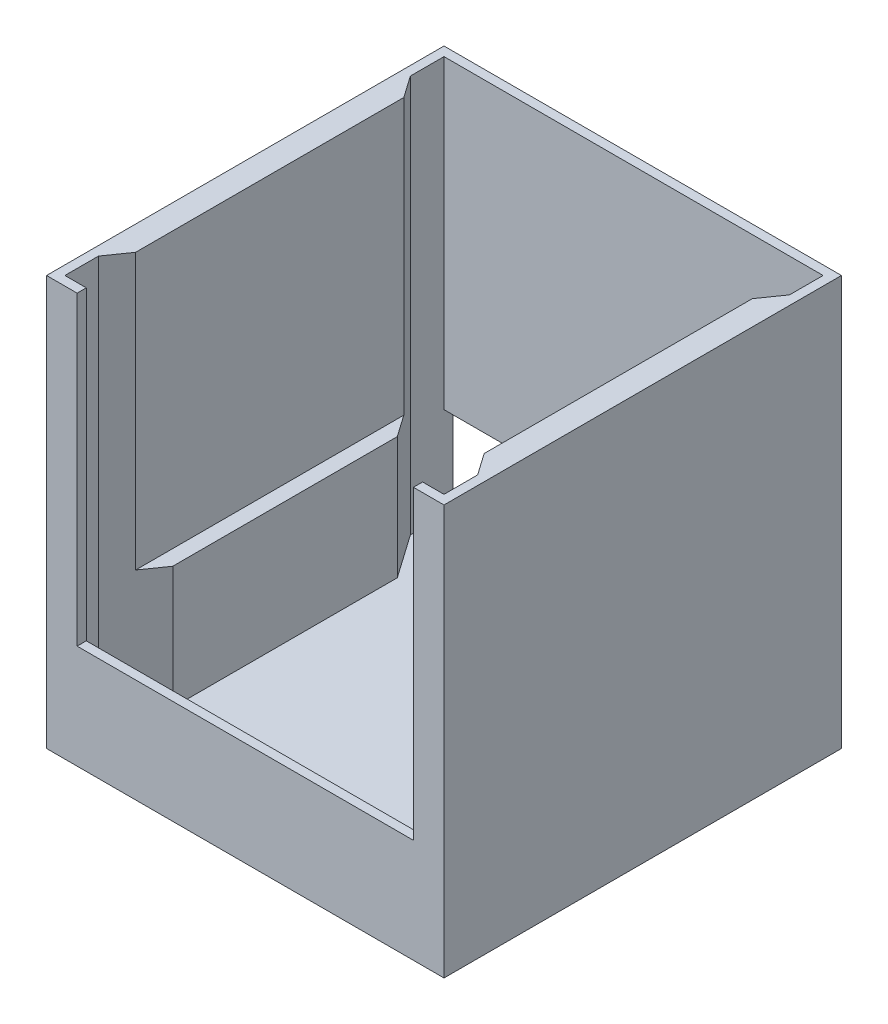
ISO-10303-21;
HEADER;
FILE_DESCRIPTION(('STEP AP214'),'2;1');
FILE_NAME('part.step','',(''),(''),'','','');
FILE_SCHEMA(('AUTOMOTIVE_DESIGN { 1 0 10303 214 1 1 1 1 }'));
ENDSEC;
DATA;
#1=APPLICATION_CONTEXT('core data for automotive mechanical design processes');
#2=APPLICATION_PROTOCOL_DEFINITION('international standard','automotive_design',2000,#1);
#3=PRODUCT_CONTEXT('',#1,'mechanical');
#4=PRODUCT('Part','Part','',(#3));
#5=PRODUCT_RELATED_PRODUCT_CATEGORY('part','',(#4));
#6=PRODUCT_DEFINITION_FORMATION('','',#4);
#7=PRODUCT_DEFINITION_CONTEXT('part definition',#1,'design');
#8=PRODUCT_DEFINITION('design','',#6,#7);
#9=PRODUCT_DEFINITION_SHAPE('','',#8);
#10=(LENGTH_UNIT() NAMED_UNIT(*) SI_UNIT(.MILLI.,.METRE.));
#11=(NAMED_UNIT(*) PLANE_ANGLE_UNIT() SI_UNIT($,.RADIAN.));
#12=(NAMED_UNIT(*) SI_UNIT($,.STERADIAN.) SOLID_ANGLE_UNIT());
#13=UNCERTAINTY_MEASURE_WITH_UNIT(LENGTH_MEASURE(1.E-05),#10,'distance_accuracy_value','');
#14=(GEOMETRIC_REPRESENTATION_CONTEXT(3) GLOBAL_UNCERTAINTY_ASSIGNED_CONTEXT((#13)) GLOBAL_UNIT_ASSIGNED_CONTEXT((#10,
#11,#12)) REPRESENTATION_CONTEXT('',''));
#15=CARTESIAN_POINT('',(0.,0.,0.));
#16=DIRECTION('',(0.,0.,1.));
#17=DIRECTION('',(1.,0.,0.));
#18=AXIS2_PLACEMENT_3D('',#15,#16,#17);
#19=CARTESIAN_POINT('',(72.39,127.,0.));
#20=DIRECTION('',(1.,0.,0.));
#21=DIRECTION('',(0.,0.,-1.));
#22=AXIS2_PLACEMENT_3D('',#19,#20,#21);
#23=PLANE('',#22);
#24=DIRECTION('',(0.,0.,1.));
#25=VECTOR('',#24,1.);
#26=CARTESIAN_POINT('',(72.39,127.,0.));
#27=LINE('',#26,#25);
#28=CARTESIAN_POINT('',(72.39,127.,-55.7012601571876));
#29=VERTEX_POINT('',#28);
#30=CARTESIAN_POINT('',(72.39,127.,55.7012601571877));
#31=VERTEX_POINT('',#30);
#32=EDGE_CURVE('E292',#29,#31,#27,.T.);
#33=ORIENTED_EDGE('',*,*,#32,.F.);
#34=DIRECTION('',(0.,-1.,0.));
#35=VECTOR('',#34,1.);
#36=CARTESIAN_POINT('',(72.39,127.,-55.7012601571876));
#37=LINE('',#36,#35);
#38=CARTESIAN_POINT('',(72.39,12.7,-55.7012601571877));
#39=VERTEX_POINT('',#38);
#40=EDGE_CURVE('E517',#29,#39,#37,.T.);
#41=ORIENTED_EDGE('',*,*,#40,.T.);
#42=DIRECTION('',(0.,0.,1.));
#43=VECTOR('',#42,1.);
#44=CARTESIAN_POINT('',(72.39,12.7,-64.77));
#45=LINE('',#44,#43);
#46=CARTESIAN_POINT('',(72.39,12.7,55.7012601571876));
#47=VERTEX_POINT('',#46);
#48=EDGE_CURVE('E525',#39,#47,#45,.T.);
#49=ORIENTED_EDGE('',*,*,#48,.T.);
#50=DIRECTION('',(0.,-1.,0.));
#51=VECTOR('',#50,1.);
#52=CARTESIAN_POINT('',(72.39,127.,55.7012601571876));
#53=LINE('',#52,#51);
#54=EDGE_CURVE('E514',#31,#47,#53,.T.);
#55=ORIENTED_EDGE('',*,*,#54,.F.);
#56=EDGE_LOOP('',(#33,#41,#49,#55));
#57=FACE_BOUND('',#56,.T.);
#58=ADVANCED_FACE('F45',(#57),#23,.F.);
#59=CARTESIAN_POINT('',(-72.39,127.,0.));
#60=DIRECTION('',(1.,0.,0.));
#61=DIRECTION('',(0.,0.,-1.));
#62=AXIS2_PLACEMENT_3D('',#59,#60,#61);
#63=PLANE('',#62);
#64=DIRECTION('',(0.,1.,0.));
#65=VECTOR('',#64,1.);
#66=CARTESIAN_POINT('',(-72.39,127.,55.7012601571876));
#67=LINE('',#66,#65);
#68=CARTESIAN_POINT('',(-72.39,12.7,55.7012601571876));
#69=VERTEX_POINT('',#68);
#70=CARTESIAN_POINT('',(-72.39,127.,55.7012601571876));
#71=VERTEX_POINT('',#70);
#72=EDGE_CURVE('E390',#69,#71,#67,.T.);
#73=ORIENTED_EDGE('',*,*,#72,.F.);
#74=DIRECTION('',(0.,0.,1.));
#75=VECTOR('',#74,1.);
#76=CARTESIAN_POINT('',(-72.39,12.7,0.));
#77=LINE('',#76,#75);
#78=CARTESIAN_POINT('',(-72.39,12.7,-55.7012601571876));
#79=VERTEX_POINT('',#78);
#80=EDGE_CURVE('E382',#79,#69,#77,.T.);
#81=ORIENTED_EDGE('',*,*,#80,.F.);
#82=DIRECTION('',(0.,1.,0.));
#83=VECTOR('',#82,1.);
#84=CARTESIAN_POINT('',(-72.39,127.,-55.7012601571876));
#85=LINE('',#84,#83);
#86=CARTESIAN_POINT('',(-72.39,127.,-55.7012601571876));
#87=VERTEX_POINT('',#86);
#88=EDGE_CURVE('E61',#79,#87,#85,.T.);
#89=ORIENTED_EDGE('',*,*,#88,.T.);
#90=DIRECTION('',(0.,0.,1.));
#91=VECTOR('',#90,1.);
#92=CARTESIAN_POINT('',(-72.39,127.,0.));
#93=LINE('',#92,#91);
#94=EDGE_CURVE('E305',#87,#71,#93,.T.);
#95=ORIENTED_EDGE('',*,*,#94,.T.);
#96=EDGE_LOOP('',(#73,#81,#89,#95));
#97=FACE_BOUND('',#96,.T.);
#98=ADVANCED_FACE('F388',(#97),#63,.T.);
#99=CARTESIAN_POINT('',(0.,127.,0.));
#100=DIRECTION('',(0.,1.,0.));
#101=DIRECTION('',(0.,0.,1.));
#102=AXIS2_PLACEMENT_3D('',#99,#100,#101);
#103=PLANE('',#102);
#104=DIRECTION('',(0.573576436351047,0.,-0.819152044288991));
#105=VECTOR('',#104,1.);
#106=CARTESIAN_POINT('',(-78.74,127.,64.77));
#107=LINE('',#106,#105);
#108=CARTESIAN_POINT('',(-78.74,127.,64.77));
#109=VERTEX_POINT('',#108);
#110=EDGE_CURVE('E489',#109,#71,#107,.T.);
#111=ORIENTED_EDGE('',*,*,#110,.T.);
#112=ORIENTED_EDGE('',*,*,#94,.F.);
#113=DIRECTION('',(0.573576436351048,0.,0.819152044288991));
#114=VECTOR('',#113,1.);
#115=CARTESIAN_POINT('',(-22.4033875185798,127.,15.6870208219429));
#116=LINE('',#115,#114);
#117=CARTESIAN_POINT('',(-78.74,127.,-64.77));
#118=VERTEX_POINT('',#117);
#119=EDGE_CURVE('E505',#118,#87,#116,.T.);
#120=ORIENTED_EDGE('',*,*,#119,.F.);
#121=DIRECTION('',(0.,0.,-1.));
#122=VECTOR('',#121,1.);
#123=CARTESIAN_POINT('',(-78.74,127.,0.));
#124=LINE('',#123,#122);
#125=CARTESIAN_POINT('',(-78.74,127.,-78.74));
#126=VERTEX_POINT('',#125);
#127=EDGE_CURVE('E306',#118,#126,#124,.T.);
#128=ORIENTED_EDGE('',*,*,#127,.T.);
#129=DIRECTION('',(1.,0.,0.));
#130=VECTOR('',#129,1.);
#131=CARTESIAN_POINT('',(0.,127.,-78.74));
#132=LINE('',#131,#130);
#133=CARTESIAN_POINT('',(78.74,127.,-78.74));
#134=VERTEX_POINT('',#133);
#135=EDGE_CURVE('E284',#126,#134,#132,.T.);
#136=ORIENTED_EDGE('',*,*,#135,.T.);
#137=DIRECTION('',(0.,0.,-1.));
#138=VECTOR('',#137,1.);
#139=CARTESIAN_POINT('',(78.74,127.,0.));
#140=LINE('',#139,#138);
#141=CARTESIAN_POINT('',(78.74,127.,-64.77));
#142=VERTEX_POINT('',#141);
#143=EDGE_CURVE('E287',#142,#134,#140,.T.);
#144=ORIENTED_EDGE('',*,*,#143,.F.);
#145=DIRECTION('',(-0.573576436351047,0.,0.819152044288991));
#146=VECTOR('',#145,1.);
#147=CARTESIAN_POINT('',(78.74,127.,-64.77));
#148=LINE('',#147,#146);
#149=EDGE_CURVE('E500',#142,#29,#148,.T.);
#150=ORIENTED_EDGE('',*,*,#149,.T.);
#151=ORIENTED_EDGE('',*,*,#32,.T.);
#152=DIRECTION('',(-0.573576436351047,0.,-0.819152044288991));
#153=VECTOR('',#152,1.);
#154=CARTESIAN_POINT('',(78.74,127.,64.77));
#155=LINE('',#154,#153);
#156=CARTESIAN_POINT('',(78.74,127.,64.77));
#157=VERTEX_POINT('',#156);
#158=EDGE_CURVE('E230',#157,#31,#155,.T.);
#159=ORIENTED_EDGE('',*,*,#158,.F.);
#160=CARTESIAN_POINT('',(78.74,127.,78.74));
#161=VERTEX_POINT('',#160);
#162=EDGE_CURVE('E239',#161,#157,#140,.T.);
#163=ORIENTED_EDGE('',*,*,#162,.F.);
#164=DIRECTION('',(1.,0.,0.));
#165=VECTOR('',#164,1.);
#166=CARTESIAN_POINT('',(0.,127.,78.74));
#167=LINE('',#166,#165);
#168=CARTESIAN_POINT('',(69.85,127.,78.74));
#169=VERTEX_POINT('',#168);
#170=EDGE_CURVE('E301',#169,#161,#167,.T.);
#171=ORIENTED_EDGE('',*,*,#170,.F.);
#172=DIRECTION('',(0.,0.,-1.));
#173=VECTOR('',#172,1.);
#174=CARTESIAN_POINT('',(69.85,127.,0.));
#175=LINE('',#174,#173);
#176=CARTESIAN_POINT('',(69.85,127.,82.5500000000001));
#177=VERTEX_POINT('',#176);
#178=EDGE_CURVE('E271',#177,#169,#175,.T.);
#179=ORIENTED_EDGE('',*,*,#178,.F.);
#180=DIRECTION('',(1.,0.,0.));
#181=VECTOR('',#180,1.);
#182=CARTESIAN_POINT('',(0.,127.,82.5500000000001));
#183=LINE('',#182,#181);
#184=CARTESIAN_POINT('',(82.55,127.,82.5500000000001));
#185=VERTEX_POINT('',#184);
#186=EDGE_CURVE('E321',#177,#185,#183,.T.);
#187=ORIENTED_EDGE('',*,*,#186,.T.);
#188=DIRECTION('',(0.,0.,-1.));
#189=VECTOR('',#188,1.);
#190=CARTESIAN_POINT('',(82.5499999999999,127.,0.));
#191=LINE('',#190,#189);
#192=CARTESIAN_POINT('',(82.5499999999999,127.,-82.5499999999999));
#193=VERTEX_POINT('',#192);
#194=EDGE_CURVE('E310',#185,#193,#191,.T.);
#195=ORIENTED_EDGE('',*,*,#194,.T.);
#196=DIRECTION('',(1.,0.,0.));
#197=VECTOR('',#196,1.);
#198=CARTESIAN_POINT('',(0.,127.,-82.5499999999999));
#199=LINE('',#198,#197);
#200=CARTESIAN_POINT('',(-82.5500000000001,127.,-82.5499999999999));
#201=VERTEX_POINT('',#200);
#202=EDGE_CURVE('E313',#201,#193,#199,.T.);
#203=ORIENTED_EDGE('',*,*,#202,.F.);
#204=DIRECTION('',(0.,0.,-1.));
#205=VECTOR('',#204,1.);
#206=CARTESIAN_POINT('',(-82.55,127.,0.));
#207=LINE('',#206,#205);
#208=CARTESIAN_POINT('',(-82.5499999999999,127.,82.5500000000001));
#209=VERTEX_POINT('',#208);
#210=EDGE_CURVE('E317',#209,#201,#207,.T.);
#211=ORIENTED_EDGE('',*,*,#210,.F.);
#212=CARTESIAN_POINT('',(-69.8499999999999,127.,82.5500000000001));
#213=VERTEX_POINT('',#212);
#214=EDGE_CURVE('E322',#209,#213,#183,.T.);
#215=ORIENTED_EDGE('',*,*,#214,.T.);
#216=DIRECTION('',(0.,0.,1.));
#217=VECTOR('',#216,1.);
#218=CARTESIAN_POINT('',(-69.8499999999999,127.,0.));
#219=LINE('',#218,#217);
#220=CARTESIAN_POINT('',(-69.8499999999999,127.,78.74));
#221=VERTEX_POINT('',#220);
#222=EDGE_CURVE('E367',#221,#213,#219,.T.);
#223=ORIENTED_EDGE('',*,*,#222,.F.);
#224=CARTESIAN_POINT('',(-78.74,127.,78.74));
#225=VERTEX_POINT('',#224);
#226=EDGE_CURVE('E296',#225,#221,#167,.T.);
#227=ORIENTED_EDGE('',*,*,#226,.F.);
#228=EDGE_CURVE('E300',#225,#109,#124,.T.);
#229=ORIENTED_EDGE('',*,*,#228,.T.);
#230=EDGE_LOOP('',(#111,#112,#120,#128,#136,#144,#150,#151,#159,#163,#171,#179,#187,#195,#203,
#211,#215,#223,#227,#229));
#231=FACE_BOUND('',#230,.T.);
#232=ADVANCED_FACE('F478',(#231),#103,.T.);
#233=CARTESIAN_POINT('',(-66.04,12.7,0.));
#234=DIRECTION('',(1.,0.,0.));
#235=DIRECTION('',(0.,0.,-1.));
#236=AXIS2_PLACEMENT_3D('',#233,#234,#235);
#237=PLANE('',#236);
#238=DIRECTION('',(0.,-1.,0.));
#239=VECTOR('',#238,1.);
#240=CARTESIAN_POINT('',(-66.04,127.,46.6325203143752));
#241=LINE('',#240,#239);
#242=CARTESIAN_POINT('',(-66.04,12.7,46.6325203143752));
#243=VERTEX_POINT('',#242);
#244=CARTESIAN_POINT('',(-66.04,-38.1,46.6325203143752));
#245=VERTEX_POINT('',#244);
#246=EDGE_CURVE('E68',#243,#245,#241,.T.);
#247=ORIENTED_EDGE('',*,*,#246,.T.);
#248=DIRECTION('',(0.,0.,1.));
#249=VECTOR('',#248,1.);
#250=CARTESIAN_POINT('',(-66.04,-38.1,0.));
#251=LINE('',#250,#249);
#252=CARTESIAN_POINT('',(-66.04,-38.1,-46.6325203143752));
#253=VERTEX_POINT('',#252);
#254=EDGE_CURVE('E399',#253,#245,#251,.T.);
#255=ORIENTED_EDGE('',*,*,#254,.F.);
#256=DIRECTION('',(0.,-1.,0.));
#257=VECTOR('',#256,1.);
#258=CARTESIAN_POINT('',(-66.04,127.,-46.6325203143752));
#259=LINE('',#258,#257);
#260=CARTESIAN_POINT('',(-66.04,12.7,-46.6325203143752));
#261=VERTEX_POINT('',#260);
#262=EDGE_CURVE('E508',#261,#253,#259,.T.);
#263=ORIENTED_EDGE('',*,*,#262,.F.);
#264=DIRECTION('',(0.,0.,1.));
#265=VECTOR('',#264,1.);
#266=CARTESIAN_POINT('',(-66.04,12.7,0.));
#267=LINE('',#266,#265);
#268=EDGE_CURVE('E384',#261,#243,#267,.T.);
#269=ORIENTED_EDGE('',*,*,#268,.T.);
#270=EDGE_LOOP('',(#247,#255,#263,#269));
#271=FACE_BOUND('',#270,.T.);
#272=ADVANCED_FACE('F566',(#271),#237,.T.);
#273=CARTESIAN_POINT('',(0.,12.7,0.));
#274=DIRECTION('',(0.,1.,0.));
#275=DIRECTION('',(0.,0.,1.));
#276=AXIS2_PLACEMENT_3D('',#273,#274,#275);
#277=PLANE('',#276);
#278=DIRECTION('',(-0.573576436351048,0.,0.819152044288991));
#279=VECTOR('',#278,1.);
#280=CARTESIAN_POINT('',(-22.4033875185798,12.7,-15.6870208219429));
#281=LINE('',#280,#279);
#282=EDGE_CURVE('E11',#243,#69,#281,.T.);
#283=ORIENTED_EDGE('',*,*,#282,.F.);
#284=ORIENTED_EDGE('',*,*,#268,.F.);
#285=DIRECTION('',(-0.573576436351048,0.,-0.819152044288991));
#286=VECTOR('',#285,1.);
#287=CARTESIAN_POINT('',(-22.4033875185798,12.7,15.6870208219429));
#288=LINE('',#287,#286);
#289=EDGE_CURVE('E54',#261,#79,#288,.T.);
#290=ORIENTED_EDGE('',*,*,#289,.T.);
#291=ORIENTED_EDGE('',*,*,#80,.T.);
#292=EDGE_LOOP('',(#283,#284,#290,#291));
#293=FACE_BOUND('',#292,.T.);
#294=ADVANCED_FACE('F381',(#293),#277,.T.);
#295=CARTESIAN_POINT('',(66.04,12.7,-64.77));
#296=DIRECTION('',(1.,0.,0.));
#297=DIRECTION('',(0.,0.,-1.));
#298=AXIS2_PLACEMENT_3D('',#295,#296,#297);
#299=PLANE('',#298);
#300=DIRECTION('',(0.,0.,1.));
#301=VECTOR('',#300,1.);
#302=CARTESIAN_POINT('',(66.04,12.7,-64.77));
#303=LINE('',#302,#301);
#304=CARTESIAN_POINT('',(66.04,12.7,-46.6325203143752));
#305=VERTEX_POINT('',#304);
#306=CARTESIAN_POINT('',(66.04,12.7,46.6325203143752));
#307=VERTEX_POINT('',#306);
#308=EDGE_CURVE('E528',#305,#307,#303,.T.);
#309=ORIENTED_EDGE('',*,*,#308,.F.);
#310=DIRECTION('',(0.,-1.,0.));
#311=VECTOR('',#310,1.);
#312=CARTESIAN_POINT('',(66.04,127.,-46.6325203143752));
#313=LINE('',#312,#311);
#314=CARTESIAN_POINT('',(66.04,-38.1,-46.6325203143752));
#315=VERTEX_POINT('',#314);
#316=EDGE_CURVE('E229',#305,#315,#313,.T.);
#317=ORIENTED_EDGE('',*,*,#316,.T.);
#318=DIRECTION('',(0.,0.,1.));
#319=VECTOR('',#318,1.);
#320=CARTESIAN_POINT('',(66.04,-38.1,-64.77));
#321=LINE('',#320,#319);
#322=CARTESIAN_POINT('',(66.04,-38.1,46.6325203143752));
#323=VERTEX_POINT('',#322);
#324=EDGE_CURVE('E405',#315,#323,#321,.T.);
#325=ORIENTED_EDGE('',*,*,#324,.T.);
#326=DIRECTION('',(0.,-1.,0.));
#327=VECTOR('',#326,1.);
#328=CARTESIAN_POINT('',(66.04,127.,46.6325203143752));
#329=LINE('',#328,#327);
#330=EDGE_CURVE('E223',#307,#323,#329,.T.);
#331=ORIENTED_EDGE('',*,*,#330,.F.);
#332=EDGE_LOOP('',(#309,#317,#325,#331));
#333=FACE_BOUND('',#332,.T.);
#334=ADVANCED_FACE('F539',(#333),#299,.F.);
#335=CARTESIAN_POINT('',(0.,12.7,0.));
#336=DIRECTION('',(0.,1.,0.));
#337=DIRECTION('',(0.,0.,1.));
#338=AXIS2_PLACEMENT_3D('',#335,#336,#337);
#339=PLANE('',#338);
#340=DIRECTION('',(0.573576436351048,0.,-0.819152044288991));
#341=VECTOR('',#340,1.);
#342=CARTESIAN_POINT('',(22.4033875185798,12.7,15.6870208219429));
#343=LINE('',#342,#341);
#344=EDGE_CURVE('E374',#305,#39,#343,.T.);
#345=ORIENTED_EDGE('',*,*,#344,.F.);
#346=ORIENTED_EDGE('',*,*,#308,.T.);
#347=DIRECTION('',(0.573576436351048,0.,0.819152044288991));
#348=VECTOR('',#347,1.);
#349=CARTESIAN_POINT('',(22.4033875185798,12.7,-15.6870208219429));
#350=LINE('',#349,#348);
#351=EDGE_CURVE('E370',#307,#47,#350,.T.);
#352=ORIENTED_EDGE('',*,*,#351,.T.);
#353=ORIENTED_EDGE('',*,*,#48,.F.);
#354=EDGE_LOOP('',(#345,#346,#352,#353));
#355=FACE_BOUND('',#354,.T.);
#356=ADVANCED_FACE('F536',(#355),#339,.T.);
#357=CARTESIAN_POINT('',(0.,-38.1,0.));
#358=DIRECTION('',(0.,-1.,0.));
#359=DIRECTION('',(0.,0.,-1.));
#360=AXIS2_PLACEMENT_3D('',#357,#358,#359);
#361=PLANE('',#360);
#362=DIRECTION('',(-0.573576436351047,0.,0.819152044288991));
#363=VECTOR('',#362,1.);
#364=CARTESIAN_POINT('',(78.74,-38.1,-64.77));
#365=LINE('',#364,#363);
#366=CARTESIAN_POINT('',(78.74,-38.1,-64.77));
#367=VERTEX_POINT('',#366);
#368=EDGE_CURVE('E490',#367,#315,#365,.T.);
#369=ORIENTED_EDGE('',*,*,#368,.F.);
#370=DIRECTION('',(0.,0.,-1.));
#371=VECTOR('',#370,1.);
#372=CARTESIAN_POINT('',(78.74,-38.1,0.));
#373=LINE('',#372,#371);
#374=CARTESIAN_POINT('',(78.74,-38.1,-82.5499999999999));
#375=VERTEX_POINT('',#374);
#376=EDGE_CURVE('E252',#367,#375,#373,.T.);
#377=ORIENTED_EDGE('',*,*,#376,.T.);
#378=DIRECTION('',(1.,0.,0.));
#379=VECTOR('',#378,1.);
#380=CARTESIAN_POINT('',(-82.5499999999999,-38.1,-82.5499999999999));
#381=LINE('',#380,#379);
#382=CARTESIAN_POINT('',(-78.74,-38.1,-82.5499999999999));
#383=VERTEX_POINT('',#382);
#384=EDGE_CURVE('E260',#383,#375,#381,.T.);
#385=ORIENTED_EDGE('',*,*,#384,.F.);
#386=DIRECTION('',(0.,0.,-1.));
#387=VECTOR('',#386,1.);
#388=CARTESIAN_POINT('',(-78.74,-38.1,0.));
#389=LINE('',#388,#387);
#390=CARTESIAN_POINT('',(-78.74,-38.1,-64.77));
#391=VERTEX_POINT('',#390);
#392=EDGE_CURVE('E251',#391,#383,#389,.T.);
#393=ORIENTED_EDGE('',*,*,#392,.F.);
#394=DIRECTION('',(0.573576436351048,0.,0.819152044288991));
#395=VECTOR('',#394,1.);
#396=CARTESIAN_POINT('',(-22.4033875185798,-38.1,15.6870208219429));
#397=LINE('',#396,#395);
#398=EDGE_CURVE('E494',#391,#253,#397,.T.);
#399=ORIENTED_EDGE('',*,*,#398,.T.);
#400=ORIENTED_EDGE('',*,*,#254,.T.);
#401=DIRECTION('',(0.573576436351047,0.,-0.819152044288991));
#402=VECTOR('',#401,1.);
#403=CARTESIAN_POINT('',(-78.74,-38.1,64.77));
#404=LINE('',#403,#402);
#405=CARTESIAN_POINT('',(-78.74,-38.1,64.77));
#406=VERTEX_POINT('',#405);
#407=EDGE_CURVE('E491',#406,#245,#404,.T.);
#408=ORIENTED_EDGE('',*,*,#407,.F.);
#409=CARTESIAN_POINT('',(-78.74,-38.1,78.74));
#410=VERTEX_POINT('',#409);
#411=EDGE_CURVE('E256',#410,#406,#389,.T.);
#412=ORIENTED_EDGE('',*,*,#411,.F.);
#413=DIRECTION('',(1.,0.,0.));
#414=VECTOR('',#413,1.);
#415=CARTESIAN_POINT('',(0.,-38.1,78.74));
#416=LINE('',#415,#414);
#417=CARTESIAN_POINT('',(78.74,-38.1,78.74));
#418=VERTEX_POINT('',#417);
#419=EDGE_CURVE('E249',#410,#418,#416,.T.);
#420=ORIENTED_EDGE('',*,*,#419,.T.);
#421=CARTESIAN_POINT('',(78.74,-38.1,64.77));
#422=VERTEX_POINT('',#421);
#423=EDGE_CURVE('E236',#418,#422,#373,.T.);
#424=ORIENTED_EDGE('',*,*,#423,.T.);
#425=DIRECTION('',(-0.573576436351047,0.,-0.819152044288991));
#426=VECTOR('',#425,1.);
#427=CARTESIAN_POINT('',(78.74,-38.1,64.77));
#428=LINE('',#427,#426);
#429=EDGE_CURVE('E217',#422,#323,#428,.T.);
#430=ORIENTED_EDGE('',*,*,#429,.T.);
#431=ORIENTED_EDGE('',*,*,#324,.F.);
#432=EDGE_LOOP('',(#369,#377,#385,#393,#399,#400,#408,#412,#420,#424,#430,#431));
#433=FACE_BOUND('',#432,.T.);
#434=ADVANCED_FACE('F246',(#433),#361,.F.);
#435=CARTESIAN_POINT('',(-78.74,127.,0.));
#436=DIRECTION('',(-1.,0.,0.));
#437=DIRECTION('',(0.,0.,1.));
#438=AXIS2_PLACEMENT_3D('',#435,#436,#437);
#439=PLANE('',#438);
#440=DIRECTION('',(0.,-1.,0.));
#441=VECTOR('',#440,1.);
#442=CARTESIAN_POINT('',(-78.74,127.,-64.77));
#443=LINE('',#442,#441);
#444=EDGE_CURVE('E348',#118,#391,#443,.T.);
#445=ORIENTED_EDGE('',*,*,#444,.T.);
#446=ORIENTED_EDGE('',*,*,#392,.T.);
#447=DIRECTION('',(0.,1.,0.));
#448=VECTOR('',#447,1.);
#449=CARTESIAN_POINT('',(-78.74,-38.1,-82.5499999999999));
#450=LINE('',#449,#448);
#451=CARTESIAN_POINT('',(-78.74,0.,-82.5499999999999));
#452=VERTEX_POINT('',#451);
#453=EDGE_CURVE('E267',#383,#452,#450,.T.);
#454=ORIENTED_EDGE('',*,*,#453,.T.);
#455=DIRECTION('',(0.,0.,-1.));
#456=VECTOR('',#455,1.);
#457=CARTESIAN_POINT('',(-78.74,0.,0.));
#458=LINE('',#457,#456);
#459=CARTESIAN_POINT('',(-78.74,0.,-78.74));
#460=VERTEX_POINT('',#459);
#461=EDGE_CURVE('E272',#460,#452,#458,.T.);
#462=ORIENTED_EDGE('',*,*,#461,.F.);
#463=DIRECTION('',(0.,-1.,0.));
#464=VECTOR('',#463,1.);
#465=CARTESIAN_POINT('',(-78.74,127.,-78.74));
#466=LINE('',#465,#464);
#467=EDGE_CURVE('E326',#126,#460,#466,.T.);
#468=ORIENTED_EDGE('',*,*,#467,.F.);
#469=ORIENTED_EDGE('',*,*,#127,.F.);
#470=EDGE_LOOP('',(#445,#446,#454,#462,#468,#469));
#471=FACE_BOUND('',#470,.T.);
#472=ADVANCED_FACE('F555',(#471),#439,.F.);
#473=CARTESIAN_POINT('',(78.74,127.,0.));
#474=DIRECTION('',(-1.,0.,0.));
#475=DIRECTION('',(0.,0.,1.));
#476=AXIS2_PLACEMENT_3D('',#473,#474,#475);
#477=PLANE('',#476);
#478=DIRECTION('',(0.,-1.,0.));
#479=VECTOR('',#478,1.);
#480=CARTESIAN_POINT('',(78.74,127.,64.77));
#481=LINE('',#480,#479);
#482=EDGE_CURVE('E220',#157,#422,#481,.T.);
#483=ORIENTED_EDGE('',*,*,#482,.T.);
#484=ORIENTED_EDGE('',*,*,#423,.F.);
#485=DIRECTION('',(0.,-1.,0.));
#486=VECTOR('',#485,1.);
#487=CARTESIAN_POINT('',(78.74,127.,78.74));
#488=LINE('',#487,#486);
#489=EDGE_CURVE('E242',#161,#418,#488,.T.);
#490=ORIENTED_EDGE('',*,*,#489,.F.);
#491=ORIENTED_EDGE('',*,*,#162,.T.);
#492=EDGE_LOOP('',(#483,#484,#490,#491));
#493=FACE_BOUND('',#492,.T.);
#494=ADVANCED_FACE('F234',(#493),#477,.T.);
#495=CARTESIAN_POINT('',(0.,0.,0.));
#496=DIRECTION('',(0.,1.,0.));
#497=DIRECTION('',(0.,0.,1.));
#498=AXIS2_PLACEMENT_3D('',#495,#496,#497);
#499=PLANE('',#498);
#500=DIRECTION('',(0.,0.,-1.));
#501=VECTOR('',#500,1.);
#502=CARTESIAN_POINT('',(78.74,0.,0.));
#503=LINE('',#502,#501);
#504=CARTESIAN_POINT('',(78.74,0.,-78.74));
#505=VERTEX_POINT('',#504);
#506=CARTESIAN_POINT('',(78.74,0.,-82.5499999999999));
#507=VERTEX_POINT('',#506);
#508=EDGE_CURVE('E268',#505,#507,#503,.T.);
#509=ORIENTED_EDGE('',*,*,#508,.F.);
#510=DIRECTION('',(1.,0.,0.));
#511=VECTOR('',#510,1.);
#512=CARTESIAN_POINT('',(0.,0.,-78.74));
#513=LINE('',#512,#511);
#514=EDGE_CURVE('E283',#460,#505,#513,.T.);
#515=ORIENTED_EDGE('',*,*,#514,.F.);
#516=ORIENTED_EDGE('',*,*,#461,.T.);
#517=DIRECTION('',(1.,0.,0.));
#518=VECTOR('',#517,1.);
#519=CARTESIAN_POINT('',(0.,0.,-82.5499999999999));
#520=LINE('',#519,#518);
#521=EDGE_CURVE('E288',#452,#507,#520,.T.);
#522=ORIENTED_EDGE('',*,*,#521,.T.);
#523=EDGE_LOOP('',(#509,#515,#516,#522));
#524=FACE_BOUND('',#523,.T.);
#525=ADVANCED_FACE('F603',(#524),#499,.F.);
#526=CARTESIAN_POINT('',(82.5499999999999,127.,0.));
#527=DIRECTION('',(-1.,0.,0.));
#528=DIRECTION('',(0.,0.,1.));
#529=AXIS2_PLACEMENT_3D('',#526,#527,#528);
#530=PLANE('',#529);
#531=DIRECTION('',(0.,-1.,0.));
#532=VECTOR('',#531,1.);
#533=CARTESIAN_POINT('',(82.55,127.,82.5500000000001));
#534=LINE('',#533,#532);
#535=CARTESIAN_POINT('',(82.5500000000001,-43.18,82.5500000000001));
#536=VERTEX_POINT('',#535);
#537=EDGE_CURVE('E333',#185,#536,#534,.T.);
#538=ORIENTED_EDGE('',*,*,#537,.T.);
#539=DIRECTION('',(0.,0.,1.));
#540=VECTOR('',#539,1.);
#541=CARTESIAN_POINT('',(82.5500000000001,-43.18,82.5500000000001));
#542=LINE('',#541,#540);
#543=CARTESIAN_POINT('',(82.5499999999999,-43.18,-82.5499999999999));
#544=VERTEX_POINT('',#543);
#545=EDGE_CURVE('E436',#544,#536,#542,.T.);
#546=ORIENTED_EDGE('',*,*,#545,.F.);
#547=DIRECTION('',(0.,-1.,0.));
#548=VECTOR('',#547,1.);
#549=CARTESIAN_POINT('',(82.5499999999999,127.,-82.5499999999999));
#550=LINE('',#549,#548);
#551=EDGE_CURVE('E276',#193,#544,#550,.T.);
#552=ORIENTED_EDGE('',*,*,#551,.F.);
#553=ORIENTED_EDGE('',*,*,#194,.F.);
#554=EDGE_LOOP('',(#538,#546,#552,#553));
#555=FACE_BOUND('',#554,.T.);
#556=ADVANCED_FACE('F459',(#555),#530,.F.);
#557=CARTESIAN_POINT('',(0.,127.,-82.5499999999999));
#558=DIRECTION('',(0.,0.,-1.));
#559=DIRECTION('',(-1.,0.,0.));
#560=AXIS2_PLACEMENT_3D('',#557,#558,#559);
#561=PLANE('',#560);
#562=ORIENTED_EDGE('',*,*,#551,.T.);
#563=DIRECTION('',(1.,0.,0.));
#564=VECTOR('',#563,1.);
#565=CARTESIAN_POINT('',(-82.5499999999999,-43.18,-82.5499999999999));
#566=LINE('',#565,#564);
#567=CARTESIAN_POINT('',(-82.5499999999999,-43.18,-82.5499999999999));
#568=VERTEX_POINT('',#567);
#569=EDGE_CURVE('E432',#568,#544,#566,.T.);
#570=ORIENTED_EDGE('',*,*,#569,.F.);
#571=DIRECTION('',(0.,-1.,0.));
#572=VECTOR('',#571,1.);
#573=CARTESIAN_POINT('',(-82.5500000000001,127.,-82.5499999999999));
#574=LINE('',#573,#572);
#575=EDGE_CURVE('E340',#201,#568,#574,.T.);
#576=ORIENTED_EDGE('',*,*,#575,.F.);
#577=ORIENTED_EDGE('',*,*,#202,.T.);
#578=EDGE_LOOP('',(#562,#570,#576,#577));
#579=FACE_BOUND('',#578,.T.);
#580=ORIENTED_EDGE('',*,*,#521,.F.);
#581=ORIENTED_EDGE('',*,*,#453,.F.);
#582=ORIENTED_EDGE('',*,*,#384,.T.);
#583=DIRECTION('',(0.,1.,0.));
#584=VECTOR('',#583,1.);
#585=CARTESIAN_POINT('',(78.74,-38.1,-82.5499999999999));
#586=LINE('',#585,#584);
#587=EDGE_CURVE('E279',#375,#507,#586,.T.);
#588=ORIENTED_EDGE('',*,*,#587,.T.);
#589=EDGE_LOOP('',(#580,#581,#582,#588));
#590=FACE_BOUND('',#589,.T.);
#591=ADVANCED_FACE('F455',(#579,#590),#561,.T.);
#592=CARTESIAN_POINT('',(-82.55,127.,0.));
#593=DIRECTION('',(-1.,0.,0.));
#594=DIRECTION('',(0.,0.,1.));
#595=AXIS2_PLACEMENT_3D('',#592,#593,#594);
#596=PLANE('',#595);
#597=ORIENTED_EDGE('',*,*,#575,.T.);
#598=DIRECTION('',(0.,0.,-1.));
#599=VECTOR('',#598,1.);
#600=CARTESIAN_POINT('',(-82.5499999999999,-43.18,82.5500000000001));
#601=LINE('',#600,#599);
#602=CARTESIAN_POINT('',(-82.5499999999999,-43.18,82.5500000000001));
#603=VERTEX_POINT('',#602);
#604=EDGE_CURVE('E428',#603,#568,#601,.T.);
#605=ORIENTED_EDGE('',*,*,#604,.F.);
#606=DIRECTION('',(0.,-1.,0.));
#607=VECTOR('',#606,1.);
#608=CARTESIAN_POINT('',(-82.5499999999999,127.,82.5500000000001));
#609=LINE('',#608,#607);
#610=EDGE_CURVE('E336',#209,#603,#609,.T.);
#611=ORIENTED_EDGE('',*,*,#610,.F.);
#612=ORIENTED_EDGE('',*,*,#210,.T.);
#613=EDGE_LOOP('',(#597,#605,#611,#612));
#614=FACE_BOUND('',#613,.T.);
#615=ADVANCED_FACE('F449',(#614),#596,.T.);
#616=CARTESIAN_POINT('',(0.,127.,-78.74));
#617=DIRECTION('',(0.,0.,-1.));
#618=DIRECTION('',(-1.,0.,0.));
#619=AXIS2_PLACEMENT_3D('',#616,#617,#618);
#620=PLANE('',#619);
#621=ORIENTED_EDGE('',*,*,#514,.T.);
#622=DIRECTION('',(0.,-1.,0.));
#623=VECTOR('',#622,1.);
#624=CARTESIAN_POINT('',(78.74,127.,-78.74));
#625=LINE('',#624,#623);
#626=EDGE_CURVE('E337',#134,#505,#625,.T.);
#627=ORIENTED_EDGE('',*,*,#626,.F.);
#628=ORIENTED_EDGE('',*,*,#135,.F.);
#629=ORIENTED_EDGE('',*,*,#467,.T.);
#630=EDGE_LOOP('',(#621,#627,#628,#629));
#631=FACE_BOUND('',#630,.T.);
#632=ADVANCED_FACE('F47',(#631),#620,.F.);
#633=ORIENTED_EDGE('',*,*,#376,.F.);
#634=DIRECTION('',(0.,-1.,0.));
#635=VECTOR('',#634,1.);
#636=CARTESIAN_POINT('',(78.74,127.,-64.77));
#637=LINE('',#636,#635);
#638=EDGE_CURVE('E241',#142,#367,#637,.T.);
#639=ORIENTED_EDGE('',*,*,#638,.F.);
#640=ORIENTED_EDGE('',*,*,#143,.T.);
#641=ORIENTED_EDGE('',*,*,#626,.T.);
#642=ORIENTED_EDGE('',*,*,#508,.T.);
#643=ORIENTED_EDGE('',*,*,#587,.F.);
#644=EDGE_LOOP('',(#633,#639,#640,#641,#642,#643));
#645=FACE_BOUND('',#644,.T.);
#646=ADVANCED_FACE('F546',(#645),#477,.T.);
#647=CARTESIAN_POINT('',(0.,127.,78.74));
#648=DIRECTION('',(0.,0.,-1.));
#649=DIRECTION('',(-1.,0.,0.));
#650=AXIS2_PLACEMENT_3D('',#647,#648,#649);
#651=PLANE('',#650);
#652=DIRECTION('',(0.,1.,0.));
#653=VECTOR('',#652,1.);
#654=CARTESIAN_POINT('',(-69.8499999999999,127.,78.74));
#655=LINE('',#654,#653);
#656=CARTESIAN_POINT('',(-69.8499999999999,0.,78.74));
#657=VERTEX_POINT('',#656);
#658=EDGE_CURVE('E422',#657,#221,#655,.T.);
#659=ORIENTED_EDGE('',*,*,#658,.F.);
#660=DIRECTION('',(-1.,0.,0.));
#661=VECTOR('',#660,1.);
#662=CARTESIAN_POINT('',(0.,0.,78.74));
#663=LINE('',#662,#661);
#664=CARTESIAN_POINT('',(69.85,0.,78.74));
#665=VERTEX_POINT('',#664);
#666=EDGE_CURVE('E425',#665,#657,#663,.T.);
#667=ORIENTED_EDGE('',*,*,#666,.F.);
#668=DIRECTION('',(0.,-1.,0.));
#669=VECTOR('',#668,1.);
#670=CARTESIAN_POINT('',(69.85,127.,78.74));
#671=LINE('',#670,#669);
#672=EDGE_CURVE('E417',#169,#665,#671,.T.);
#673=ORIENTED_EDGE('',*,*,#672,.F.);
#674=ORIENTED_EDGE('',*,*,#170,.T.);
#675=ORIENTED_EDGE('',*,*,#489,.T.);
#676=ORIENTED_EDGE('',*,*,#419,.F.);
#677=DIRECTION('',(0.,-1.,0.));
#678=VECTOR('',#677,1.);
#679=CARTESIAN_POINT('',(-78.74,127.,78.74));
#680=LINE('',#679,#678);
#681=EDGE_CURVE('E355',#225,#410,#680,.T.);
#682=ORIENTED_EDGE('',*,*,#681,.F.);
#683=ORIENTED_EDGE('',*,*,#226,.T.);
#684=EDGE_LOOP('',(#659,#667,#673,#674,#675,#676,#682,#683));
#685=FACE_BOUND('',#684,.T.);
#686=ADVANCED_FACE('F475',(#685),#651,.T.);
#687=ORIENTED_EDGE('',*,*,#411,.T.);
#688=DIRECTION('',(0.,-1.,0.));
#689=VECTOR('',#688,1.);
#690=CARTESIAN_POINT('',(-78.74,127.,64.77));
#691=LINE('',#690,#689);
#692=EDGE_CURVE('E352',#109,#406,#691,.T.);
#693=ORIENTED_EDGE('',*,*,#692,.F.);
#694=ORIENTED_EDGE('',*,*,#228,.F.);
#695=ORIENTED_EDGE('',*,*,#681,.T.);
#696=EDGE_LOOP('',(#687,#693,#694,#695));
#697=FACE_BOUND('',#696,.T.);
#698=ADVANCED_FACE('F568',(#697),#439,.F.);
#699=CARTESIAN_POINT('',(0.,127.,82.5500000000001));
#700=DIRECTION('',(0.,0.,-1.));
#701=DIRECTION('',(-1.,0.,0.));
#702=AXIS2_PLACEMENT_3D('',#699,#700,#701);
#703=PLANE('',#702);
#704=DIRECTION('',(1.,0.,0.));
#705=VECTOR('',#704,1.);
#706=CARTESIAN_POINT('',(-69.8499999999999,0.,82.5500000000001));
#707=LINE('',#706,#705);
#708=CARTESIAN_POINT('',(-69.8499999999999,0.,82.5500000000001));
#709=VERTEX_POINT('',#708);
#710=CARTESIAN_POINT('',(69.85,0.,82.5500000000001));
#711=VERTEX_POINT('',#710);
#712=EDGE_CURVE('E397',#709,#711,#707,.T.);
#713=ORIENTED_EDGE('',*,*,#712,.F.);
#714=DIRECTION('',(0.,-1.,0.));
#715=VECTOR('',#714,1.);
#716=CARTESIAN_POINT('',(-69.8499999999999,127.,82.5500000000001));
#717=LINE('',#716,#715);
#718=EDGE_CURVE('E392',#213,#709,#717,.T.);
#719=ORIENTED_EDGE('',*,*,#718,.F.);
#720=ORIENTED_EDGE('',*,*,#214,.F.);
#721=ORIENTED_EDGE('',*,*,#610,.T.);
#722=DIRECTION('',(-1.,0.,0.));
#723=VECTOR('',#722,1.);
#724=CARTESIAN_POINT('',(-82.5499999999999,-43.18,82.5500000000001));
#725=LINE('',#724,#723);
#726=EDGE_CURVE('E258',#536,#603,#725,.T.);
#727=ORIENTED_EDGE('',*,*,#726,.F.);
#728=ORIENTED_EDGE('',*,*,#537,.F.);
#729=ORIENTED_EDGE('',*,*,#186,.F.);
#730=DIRECTION('',(0.,1.,0.));
#731=VECTOR('',#730,1.);
#732=CARTESIAN_POINT('',(69.85,127.,82.5500000000001));
#733=LINE('',#732,#731);
#734=EDGE_CURVE('E410',#711,#177,#733,.T.);
#735=ORIENTED_EDGE('',*,*,#734,.F.);
#736=EDGE_LOOP('',(#713,#719,#720,#721,#727,#728,#729,#735));
#737=FACE_BOUND('',#736,.T.);
#738=ADVANCED_FACE('F463',(#737),#703,.F.);
#739=CARTESIAN_POINT('',(0.,-43.18,0.));
#740=DIRECTION('',(0.,-1.,0.));
#741=DIRECTION('',(0.,0.,-1.));
#742=AXIS2_PLACEMENT_3D('',#739,#740,#741);
#743=PLANE('',#742);
#744=ORIENTED_EDGE('',*,*,#604,.T.);
#745=ORIENTED_EDGE('',*,*,#569,.T.);
#746=ORIENTED_EDGE('',*,*,#545,.T.);
#747=ORIENTED_EDGE('',*,*,#726,.T.);
#748=EDGE_LOOP('',(#744,#745,#746,#747));
#749=FACE_BOUND('',#748,.T.);
#750=ADVANCED_FACE('F444',(#749),#743,.T.);
#751=CARTESIAN_POINT('',(-69.8499999999999,127.,69.8500000000001));
#752=DIRECTION('',(-1.,0.,0.));
#753=DIRECTION('',(0.,-1.,0.));
#754=AXIS2_PLACEMENT_3D('',#751,#752,#753);
#755=PLANE('',#754);
#756=ORIENTED_EDGE('',*,*,#658,.T.);
#757=ORIENTED_EDGE('',*,*,#222,.T.);
#758=ORIENTED_EDGE('',*,*,#718,.T.);
#759=DIRECTION('',(0.,0.,1.));
#760=VECTOR('',#759,1.);
#761=CARTESIAN_POINT('',(-69.8499999999999,0.,69.8500000000001));
#762=LINE('',#761,#760);
#763=EDGE_CURVE('E413',#657,#709,#762,.T.);
#764=ORIENTED_EDGE('',*,*,#763,.F.);
#765=EDGE_LOOP('',(#756,#757,#758,#764));
#766=FACE_BOUND('',#765,.T.);
#767=ADVANCED_FACE('F572',(#766),#755,.F.);
#768=CARTESIAN_POINT('',(69.85,127.,69.8500000000001));
#769=DIRECTION('',(1.,0.,0.));
#770=DIRECTION('',(0.,1.,0.));
#771=AXIS2_PLACEMENT_3D('',#768,#769,#770);
#772=PLANE('',#771);
#773=ORIENTED_EDGE('',*,*,#672,.T.);
#774=DIRECTION('',(0.,0.,1.));
#775=VECTOR('',#774,1.);
#776=CARTESIAN_POINT('',(69.85,0.,69.8500000000001));
#777=LINE('',#776,#775);
#778=EDGE_CURVE('E414',#665,#711,#777,.T.);
#779=ORIENTED_EDGE('',*,*,#778,.T.);
#780=ORIENTED_EDGE('',*,*,#734,.T.);
#781=ORIENTED_EDGE('',*,*,#178,.T.);
#782=EDGE_LOOP('',(#773,#779,#780,#781));
#783=FACE_BOUND('',#782,.T.);
#784=ADVANCED_FACE('F578',(#783),#772,.F.);
#785=CARTESIAN_POINT('',(-69.8499999999999,0.,69.8500000000001));
#786=DIRECTION('',(0.,-1.,0.));
#787=DIRECTION('',(0.,0.,-1.));
#788=AXIS2_PLACEMENT_3D('',#785,#786,#787);
#789=PLANE('',#788);
#790=ORIENTED_EDGE('',*,*,#666,.T.);
#791=ORIENTED_EDGE('',*,*,#763,.T.);
#792=ORIENTED_EDGE('',*,*,#712,.T.);
#793=ORIENTED_EDGE('',*,*,#778,.F.);
#794=EDGE_LOOP('',(#790,#791,#792,#793));
#795=FACE_BOUND('',#794,.T.);
#796=ADVANCED_FACE('F576',(#795),#789,.F.);
#797=CARTESIAN_POINT('',(78.74,127.,64.77));
#798=DIRECTION('',(-0.819152044288991,0.,0.573576436351048));
#799=DIRECTION('',(0.573576436351048,0.,0.819152044288991));
#800=AXIS2_PLACEMENT_3D('',#797,#798,#799);
#801=PLANE('',#800);
#802=ORIENTED_EDGE('',*,*,#54,.T.);
#803=ORIENTED_EDGE('',*,*,#351,.F.);
#804=ORIENTED_EDGE('',*,*,#330,.T.);
#805=ORIENTED_EDGE('',*,*,#429,.F.);
#806=ORIENTED_EDGE('',*,*,#482,.F.);
#807=ORIENTED_EDGE('',*,*,#158,.T.);
#808=EDGE_LOOP('',(#802,#803,#804,#805,#806,#807));
#809=FACE_BOUND('',#808,.T.);
#810=ADVANCED_FACE('F219',(#809),#801,.T.);
#811=CARTESIAN_POINT('',(78.74,127.,-64.77));
#812=DIRECTION('',(0.819152044288991,0.,0.573576436351048));
#813=DIRECTION('',(0.573576436351048,0.,-0.819152044288991));
#814=AXIS2_PLACEMENT_3D('',#811,#812,#813);
#815=PLANE('',#814);
#816=ORIENTED_EDGE('',*,*,#149,.F.);
#817=ORIENTED_EDGE('',*,*,#638,.T.);
#818=ORIENTED_EDGE('',*,*,#368,.T.);
#819=ORIENTED_EDGE('',*,*,#316,.F.);
#820=ORIENTED_EDGE('',*,*,#344,.T.);
#821=ORIENTED_EDGE('',*,*,#40,.F.);
#822=EDGE_LOOP('',(#816,#817,#818,#819,#820,#821));
#823=FACE_BOUND('',#822,.T.);
#824=ADVANCED_FACE('F746',(#823),#815,.F.);
#825=CARTESIAN_POINT('',(-22.4033875185798,127.,15.6870208219429));
#826=DIRECTION('',(0.819152044288991,0.,-0.573576436351048));
#827=DIRECTION('',(-0.573576436351048,0.,-0.819152044288991));
#828=AXIS2_PLACEMENT_3D('',#825,#826,#827);
#829=PLANE('',#828);
#830=ORIENTED_EDGE('',*,*,#289,.F.);
#831=ORIENTED_EDGE('',*,*,#262,.T.);
#832=ORIENTED_EDGE('',*,*,#398,.F.);
#833=ORIENTED_EDGE('',*,*,#444,.F.);
#834=ORIENTED_EDGE('',*,*,#119,.T.);
#835=ORIENTED_EDGE('',*,*,#88,.F.);
#836=EDGE_LOOP('',(#830,#831,#832,#833,#834,#835));
#837=FACE_BOUND('',#836,.T.);
#838=ADVANCED_FACE('F559',(#837),#829,.T.);
#839=CARTESIAN_POINT('',(-78.74,127.,64.77));
#840=DIRECTION('',(-0.819152044288991,0.,-0.573576436351048));
#841=DIRECTION('',(-0.573576436351048,0.,0.819152044288991));
#842=AXIS2_PLACEMENT_3D('',#839,#840,#841);
#843=PLANE('',#842);
#844=ORIENTED_EDGE('',*,*,#72,.T.);
#845=ORIENTED_EDGE('',*,*,#110,.F.);
#846=ORIENTED_EDGE('',*,*,#692,.T.);
#847=ORIENTED_EDGE('',*,*,#407,.T.);
#848=ORIENTED_EDGE('',*,*,#246,.F.);
#849=ORIENTED_EDGE('',*,*,#282,.T.);
#850=EDGE_LOOP('',(#844,#845,#846,#847,#848,#849));
#851=FACE_BOUND('',#850,.T.);
#852=ADVANCED_FACE('F563',(#851),#843,.F.);
#853=CLOSED_SHELL('',(#58,#98,#232,#272,#294,#334,#356,#434,#472,#494,#525,#556,#591,#615,#632,
#646,#686,#698,#738,#750,#767,#784,#796,#810,#824,#838,#852));
#854=MANIFOLD_SOLID_BREP('B2',#853);
#855=ADVANCED_BREP_SHAPE_REPRESENTATION('',(#18,#854),#14);
#856=SHAPE_DEFINITION_REPRESENTATION(#9,#855);
ENDSEC;
END-ISO-10303-21;
